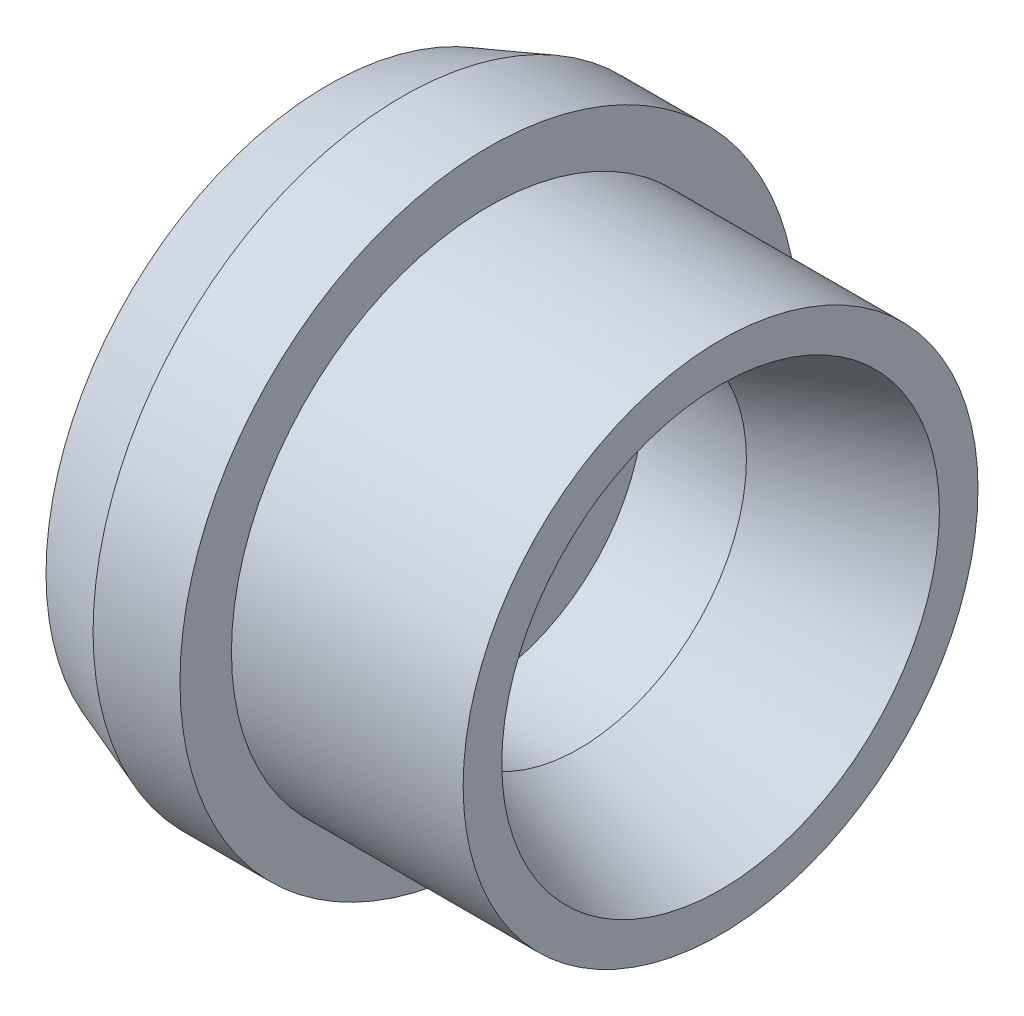
ISO-10303-21;
HEADER;
FILE_DESCRIPTION(('STEP AP214'),'2;1');
FILE_NAME('part.step','',(''),(''),'','','');
FILE_SCHEMA(('AUTOMOTIVE_DESIGN { 1 0 10303 214 1 1 1 1 }'));
ENDSEC;
DATA;
#1=APPLICATION_CONTEXT('core data for automotive mechanical design processes');
#2=APPLICATION_PROTOCOL_DEFINITION('international standard','automotive_design',2000,#1);
#3=PRODUCT_CONTEXT('',#1,'mechanical');
#4=PRODUCT('Part','Part','',(#3));
#5=PRODUCT_RELATED_PRODUCT_CATEGORY('part','',(#4));
#6=PRODUCT_DEFINITION_FORMATION('','',#4);
#7=PRODUCT_DEFINITION_CONTEXT('part definition',#1,'design');
#8=PRODUCT_DEFINITION('design','',#6,#7);
#9=PRODUCT_DEFINITION_SHAPE('','',#8);
#10=(LENGTH_UNIT() NAMED_UNIT(*) SI_UNIT(.MILLI.,.METRE.));
#11=(NAMED_UNIT(*) PLANE_ANGLE_UNIT() SI_UNIT($,.RADIAN.));
#12=(NAMED_UNIT(*) SI_UNIT($,.STERADIAN.) SOLID_ANGLE_UNIT());
#13=UNCERTAINTY_MEASURE_WITH_UNIT(LENGTH_MEASURE(1.E-05),#10,'distance_accuracy_value','');
#14=(GEOMETRIC_REPRESENTATION_CONTEXT(3) GLOBAL_UNCERTAINTY_ASSIGNED_CONTEXT((#13)) GLOBAL_UNIT_ASSIGNED_CONTEXT((#10,
#11,#12)) REPRESENTATION_CONTEXT('',''));
#15=CARTESIAN_POINT('',(0.,0.,0.));
#16=DIRECTION('',(0.,0.,1.));
#17=DIRECTION('',(1.,0.,0.));
#18=AXIS2_PLACEMENT_3D('',#15,#16,#17);
#19=CARTESIAN_POINT('',(0.,0.,0.));
#20=DIRECTION('',(-1.,0.,0.));
#21=DIRECTION('',(0.,0.,1.));
#22=AXIS2_PLACEMENT_3D('',#19,#20,#21);
#23=PLANE('',#22);
#24=CARTESIAN_POINT('',(0.,0.,0.));
#25=DIRECTION('',(1.,0.,0.));
#26=DIRECTION('',(0.,0.,-1.));
#27=AXIS2_PLACEMENT_3D('',#24,#25,#26);
#28=CIRCLE('',#27,5.56442147285421);
#29=CARTESIAN_POINT('',(0.,0.,-5.56442147285421));
#30=VERTEX_POINT('',#29);
#31=EDGE_CURVE('E10',#30,#30,#28,.T.);
#32=ORIENTED_EDGE('',*,*,#31,.F.);
#33=EDGE_LOOP('',(#32));
#34=FACE_BOUND('',#33,.T.);
#35=ADVANCED_FACE('F39',(#34),#23,.T.);
#36=CARTESIAN_POINT('',(1.4605,0.,0.));
#37=DIRECTION('',(1.,0.,0.));
#38=DIRECTION('',(0.,0.,-1.));
#39=AXIS2_PLACEMENT_3D('',#36,#37,#38);
#40=CONICAL_SURFACE('',#39,6.096,0.349065850398867);
#41=ORIENTED_EDGE('',*,*,#31,.T.);
#42=EDGE_LOOP('',(#41));
#43=FACE_BOUND('',#42,.T.);
#44=CARTESIAN_POINT('',(1.4605,0.,0.));
#45=DIRECTION('',(1.,0.,0.));
#46=DIRECTION('',(0.,0.,-1.));
#47=AXIS2_PLACEMENT_3D('',#44,#45,#46);
#48=CIRCLE('',#47,6.096);
#49=CARTESIAN_POINT('',(1.4605,0.,-6.096));
#50=VERTEX_POINT('',#49);
#51=EDGE_CURVE('E45',#50,#50,#48,.T.);
#52=ORIENTED_EDGE('',*,*,#51,.F.);
#53=EDGE_LOOP('',(#52));
#54=FACE_BOUND('',#53,.T.);
#55=ADVANCED_FACE('F87',(#43,#54),#40,.T.);
#56=CARTESIAN_POINT('',(2.921,0.,0.));
#57=DIRECTION('',(1.,0.,0.));
#58=DIRECTION('',(0.,0.,-1.));
#59=AXIS2_PLACEMENT_3D('',#56,#57,#58);
#60=CYLINDRICAL_SURFACE('',#59,6.096);
#61=ORIENTED_EDGE('',*,*,#51,.T.);
#62=EDGE_LOOP('',(#61));
#63=FACE_BOUND('',#62,.T.);
#64=CARTESIAN_POINT('',(3.175,0.,0.));
#65=DIRECTION('',(1.,0.,0.));
#66=DIRECTION('',(0.,0.,-1.));
#67=AXIS2_PLACEMENT_3D('',#64,#65,#66);
#68=CIRCLE('',#67,6.096);
#69=CARTESIAN_POINT('',(3.175,0.,-6.096));
#70=VERTEX_POINT('',#69);
#71=EDGE_CURVE('E49',#70,#70,#68,.T.);
#72=ORIENTED_EDGE('',*,*,#71,.F.);
#73=EDGE_LOOP('',(#72));
#74=FACE_BOUND('',#73,.T.);
#75=ADVANCED_FACE('F92',(#63,#74),#60,.T.);
#76=CARTESIAN_POINT('',(3.175,6.096,0.));
#77=DIRECTION('',(1.,0.,0.));
#78=DIRECTION('',(0.,0.,-1.));
#79=AXIS2_PLACEMENT_3D('',#76,#77,#78);
#80=PLANE('',#79);
#81=ORIENTED_EDGE('',*,*,#71,.T.);
#82=EDGE_LOOP('',(#81));
#83=FACE_BOUND('',#82,.T.);
#84=CARTESIAN_POINT('',(3.175,0.,0.));
#85=DIRECTION('',(1.,0.,0.));
#86=DIRECTION('',(0.,0.,-1.));
#87=AXIS2_PLACEMENT_3D('',#84,#85,#86);
#88=CIRCLE('',#87,5.08);
#89=CARTESIAN_POINT('',(3.175,0.,-5.08));
#90=VERTEX_POINT('',#89);
#91=EDGE_CURVE('E53',#90,#90,#88,.T.);
#92=ORIENTED_EDGE('',*,*,#91,.F.);
#93=EDGE_LOOP('',(#92));
#94=FACE_BOUND('',#93,.T.);
#95=ADVANCED_FACE('F96',(#83,#94),#80,.T.);
#96=CARTESIAN_POINT('',(2.921,0.,0.));
#97=DIRECTION('',(1.,0.,0.));
#98=DIRECTION('',(0.,0.,-1.));
#99=AXIS2_PLACEMENT_3D('',#96,#97,#98);
#100=CYLINDRICAL_SURFACE('',#99,5.08);
#101=ORIENTED_EDGE('',*,*,#91,.T.);
#102=EDGE_LOOP('',(#101));
#103=FACE_BOUND('',#102,.T.);
#104=CARTESIAN_POINT('',(7.747,0.,0.));
#105=DIRECTION('',(1.,0.,0.));
#106=DIRECTION('',(0.,0.,-1.));
#107=AXIS2_PLACEMENT_3D('',#104,#105,#106);
#108=CIRCLE('',#107,5.08);
#109=CARTESIAN_POINT('',(7.747,0.,-5.08));
#110=VERTEX_POINT('',#109);
#111=EDGE_CURVE('E58',#110,#110,#108,.T.);
#112=ORIENTED_EDGE('',*,*,#111,.F.);
#113=EDGE_LOOP('',(#112));
#114=FACE_BOUND('',#113,.T.);
#115=ADVANCED_FACE('F102',(#103,#114),#100,.T.);
#116=CARTESIAN_POINT('',(7.747,5.08,0.));
#117=DIRECTION('',(1.,0.,0.));
#118=DIRECTION('',(0.,0.,-1.));
#119=AXIS2_PLACEMENT_3D('',#116,#117,#118);
#120=PLANE('',#119);
#121=ORIENTED_EDGE('',*,*,#111,.T.);
#122=EDGE_LOOP('',(#121));
#123=FACE_BOUND('',#122,.T.);
#124=CARTESIAN_POINT('',(7.747,0.,0.));
#125=DIRECTION('',(1.,0.,0.));
#126=DIRECTION('',(0.,0.,-1.));
#127=AXIS2_PLACEMENT_3D('',#124,#125,#126);
#128=CIRCLE('',#127,4.318);
#129=CARTESIAN_POINT('',(7.747,0.,-4.318));
#130=VERTEX_POINT('',#129);
#131=EDGE_CURVE('E61',#130,#130,#128,.T.);
#132=ORIENTED_EDGE('',*,*,#131,.F.);
#133=EDGE_LOOP('',(#132));
#134=FACE_BOUND('',#133,.T.);
#135=ADVANCED_FACE('F83',(#123,#134),#120,.T.);
#136=CARTESIAN_POINT('',(4.95556294183411,0.,0.));
#137=DIRECTION('',(1.,0.,0.));
#138=DIRECTION('',(0.,0.,-1.));
#139=AXIS2_PLACEMENT_3D('',#136,#137,#138);
#140=CONICAL_SURFACE('',#139,3.302,0.349065850398867);
#141=ORIENTED_EDGE('',*,*,#131,.T.);
#142=EDGE_LOOP('',(#141));
#143=FACE_BOUND('',#142,.T.);
#144=CARTESIAN_POINT('',(4.95556294183411,0.,0.));
#145=DIRECTION('',(1.,0.,0.));
#146=DIRECTION('',(0.,0.,-1.));
#147=AXIS2_PLACEMENT_3D('',#144,#145,#146);
#148=CIRCLE('',#147,3.302);
#149=CARTESIAN_POINT('',(4.95556294183411,0.,-3.302));
#150=VERTEX_POINT('',#149);
#151=EDGE_CURVE('E64',#150,#150,#148,.T.);
#152=ORIENTED_EDGE('',*,*,#151,.F.);
#153=EDGE_LOOP('',(#152));
#154=FACE_BOUND('',#153,.T.);
#155=ADVANCED_FACE('F75',(#143,#154),#140,.F.);
#156=CARTESIAN_POINT('',(2.921,0.,0.));
#157=DIRECTION('',(1.,0.,0.));
#158=DIRECTION('',(0.,0.,-1.));
#159=AXIS2_PLACEMENT_3D('',#156,#157,#158);
#160=CYLINDRICAL_SURFACE('',#159,3.302);
#161=ORIENTED_EDGE('',*,*,#151,.T.);
#162=EDGE_LOOP('',(#161));
#163=FACE_BOUND('',#162,.T.);
#164=CARTESIAN_POINT('',(2.921,0.,0.));
#165=DIRECTION('',(1.,0.,0.));
#166=DIRECTION('',(0.,0.,-1.));
#167=AXIS2_PLACEMENT_3D('',#164,#165,#166);
#168=CIRCLE('',#167,3.302);
#169=CARTESIAN_POINT('',(2.921,0.,-3.302));
#170=VERTEX_POINT('',#169);
#171=EDGE_CURVE('E67',#170,#170,#168,.T.);
#172=ORIENTED_EDGE('',*,*,#171,.F.);
#173=EDGE_LOOP('',(#172));
#174=FACE_BOUND('',#173,.T.);
#175=ADVANCED_FACE('F73',(#163,#174),#160,.F.);
#176=CARTESIAN_POINT('',(2.921,3.302,0.));
#177=DIRECTION('',(1.,0.,0.));
#178=DIRECTION('',(0.,0.,-1.));
#179=AXIS2_PLACEMENT_3D('',#176,#177,#178);
#180=PLANE('',#179);
#181=ORIENTED_EDGE('',*,*,#171,.T.);
#182=EDGE_LOOP('',(#181));
#183=FACE_BOUND('',#182,.T.);
#184=ADVANCED_FACE('F71',(#183),#180,.T.);
#185=CLOSED_SHELL('',(#35,#55,#75,#95,#115,#135,#155,#175,#184));
#186=MANIFOLD_SOLID_BREP('B2',#185);
#187=ADVANCED_BREP_SHAPE_REPRESENTATION('',(#18,#186),#14);
#188=SHAPE_DEFINITION_REPRESENTATION(#9,#187);
ENDSEC;
END-ISO-10303-21;
